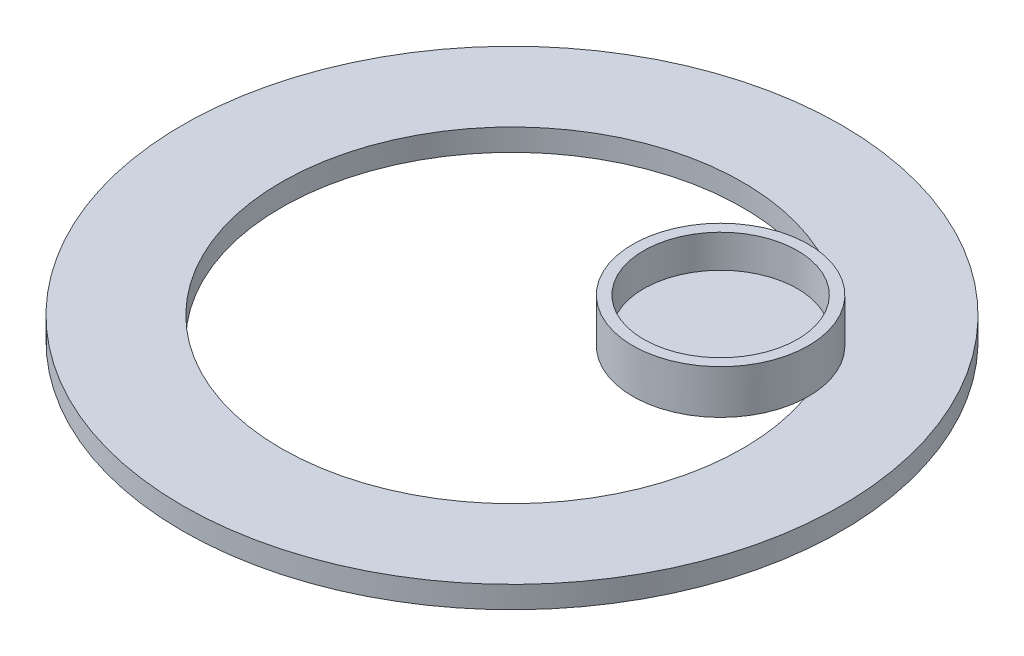
ISO-10303-21;
HEADER;
FILE_DESCRIPTION(('STEP AP214'),'2;1');
FILE_NAME('part.step','',(''),(''),'','','');
FILE_SCHEMA(('AUTOMOTIVE_DESIGN { 1 0 10303 214 1 1 1 1 }'));
ENDSEC;
DATA;
#1=APPLICATION_CONTEXT('core data for automotive mechanical design processes');
#2=APPLICATION_PROTOCOL_DEFINITION('international standard','automotive_design',2000,#1);
#3=PRODUCT_CONTEXT('',#1,'mechanical');
#4=PRODUCT('Part','Part','',(#3));
#5=PRODUCT_RELATED_PRODUCT_CATEGORY('part','',(#4));
#6=PRODUCT_DEFINITION_FORMATION('','',#4);
#7=PRODUCT_DEFINITION_CONTEXT('part definition',#1,'design');
#8=PRODUCT_DEFINITION('design','',#6,#7);
#9=PRODUCT_DEFINITION_SHAPE('','',#8);
#10=(LENGTH_UNIT() NAMED_UNIT(*) SI_UNIT(.MILLI.,.METRE.));
#11=(NAMED_UNIT(*) PLANE_ANGLE_UNIT() SI_UNIT($,.RADIAN.));
#12=(NAMED_UNIT(*) SI_UNIT($,.STERADIAN.) SOLID_ANGLE_UNIT());
#13=UNCERTAINTY_MEASURE_WITH_UNIT(LENGTH_MEASURE(1.E-05),#10,'distance_accuracy_value','');
#14=(GEOMETRIC_REPRESENTATION_CONTEXT(3) GLOBAL_UNCERTAINTY_ASSIGNED_CONTEXT((#13)) GLOBAL_UNIT_ASSIGNED_CONTEXT((#10,
#11,#12)) REPRESENTATION_CONTEXT('',''));
#15=CARTESIAN_POINT('',(0.,0.,0.));
#16=DIRECTION('',(0.,0.,1.));
#17=DIRECTION('',(1.,0.,0.));
#18=AXIS2_PLACEMENT_3D('',#15,#16,#17);
#19=CARTESIAN_POINT('',(0.,2.,0.));
#20=DIRECTION('',(0.,-1.,0.));
#21=DIRECTION('',(0.,0.,-1.));
#22=AXIS2_PLACEMENT_3D('',#19,#20,#21);
#23=CYLINDRICAL_SURFACE('',#22,30.);
#24=CARTESIAN_POINT('',(0.,2.,0.));
#25=DIRECTION('',(0.,1.,0.));
#26=DIRECTION('',(0.,0.,1.));
#27=AXIS2_PLACEMENT_3D('',#24,#25,#26);
#28=CIRCLE('',#27,30.);
#29=CARTESIAN_POINT('',(0.,2.,30.));
#30=VERTEX_POINT('',#29);
#31=EDGE_CURVE('E11',#30,#30,#28,.T.);
#32=ORIENTED_EDGE('',*,*,#31,.F.);
#33=EDGE_LOOP('',(#32));
#34=FACE_BOUND('',#33,.T.);
#35=CARTESIAN_POINT('',(0.,0.,0.));
#36=DIRECTION('',(0.,1.,0.));
#37=DIRECTION('',(0.,0.,1.));
#38=AXIS2_PLACEMENT_3D('',#35,#36,#37);
#39=CIRCLE('',#38,30.);
#40=CARTESIAN_POINT('',(0.,0.,30.));
#41=VERTEX_POINT('',#40);
#42=EDGE_CURVE('E35',#41,#41,#39,.T.);
#43=ORIENTED_EDGE('',*,*,#42,.T.);
#44=EDGE_LOOP('',(#43));
#45=FACE_BOUND('',#44,.T.);
#46=ADVANCED_FACE('F32',(#34,#45),#23,.T.);
#47=CARTESIAN_POINT('',(0.,2.,0.));
#48=DIRECTION('',(0.,1.,0.));
#49=DIRECTION('',(0.,0.,1.));
#50=AXIS2_PLACEMENT_3D('',#47,#48,#49);
#51=PLANE('',#50);
#52=CARTESIAN_POINT('',(11.8907306653898,2.,-7.09836702583289));
#53=DIRECTION('',(0.,1.,0.));
#54=DIRECTION('',(0.,0.,1.));
#55=AXIS2_PLACEMENT_3D('',#52,#53,#54);
#56=CIRCLE('',#55,8.);
#57=CARTESIAN_POINT('',(19.8834205316399,2.,-6.75644788050348));
#58=VERTEX_POINT('',#57);
#59=CARTESIAN_POINT('',(15.3824909572202,2.,-14.2961173732954));
#60=VERTEX_POINT('',#59);
#61=EDGE_CURVE('E45',#58,#60,#56,.T.);
#62=ORIENTED_EDGE('',*,*,#61,.F.);
#63=CARTESIAN_POINT('',(0.,2.,0.));
#64=DIRECTION('',(0.,1.,0.));
#65=DIRECTION('',(0.,0.,1.));
#66=AXIS2_PLACEMENT_3D('',#63,#64,#65);
#67=CIRCLE('',#66,21.);
#68=EDGE_CURVE('E52',#60,#58,#67,.T.);
#69=ORIENTED_EDGE('',*,*,#68,.F.);
#70=EDGE_LOOP('',(#62,#69));
#71=FACE_BOUND('',#70,.T.);
#72=ORIENTED_EDGE('',*,*,#31,.T.);
#73=EDGE_LOOP('',(#72));
#74=FACE_BOUND('',#73,.T.);
#75=ADVANCED_FACE('F58',(#71,#74),#51,.T.);
#76=CARTESIAN_POINT('',(0.,0.,0.));
#77=DIRECTION('',(0.,1.,0.));
#78=DIRECTION('',(0.,0.,1.));
#79=AXIS2_PLACEMENT_3D('',#76,#77,#78);
#80=PLANE('',#79);
#81=CARTESIAN_POINT('',(0.,0.,0.));
#82=DIRECTION('',(0.,1.,0.));
#83=DIRECTION('',(0.,0.,1.));
#84=AXIS2_PLACEMENT_3D('',#81,#82,#83);
#85=CIRCLE('',#84,21.);
#86=CARTESIAN_POINT('',(0.,0.,21.));
#87=VERTEX_POINT('',#86);
#88=EDGE_CURVE('E56',#87,#87,#85,.T.);
#89=ORIENTED_EDGE('',*,*,#88,.T.);
#90=EDGE_LOOP('',(#89));
#91=FACE_BOUND('',#90,.T.);
#92=ORIENTED_EDGE('',*,*,#42,.F.);
#93=EDGE_LOOP('',(#92));
#94=FACE_BOUND('',#93,.T.);
#95=ADVANCED_FACE('F78',(#91,#94),#80,.F.);
#96=CARTESIAN_POINT('',(0.,0.,0.));
#97=DIRECTION('',(0.,1.,0.));
#98=DIRECTION('',(0.,0.,1.));
#99=AXIS2_PLACEMENT_3D('',#96,#97,#98);
#100=CYLINDRICAL_SURFACE('',#99,21.);
#101=ORIENTED_EDGE('',*,*,#88,.F.);
#102=EDGE_LOOP('',(#101));
#103=FACE_BOUND('',#102,.T.);
#104=EDGE_CURVE('E50',#58,#60,#67,.T.);
#105=ORIENTED_EDGE('',*,*,#104,.T.);
#106=ORIENTED_EDGE('',*,*,#68,.T.);
#107=EDGE_LOOP('',(#105,#106));
#108=FACE_BOUND('',#107,.T.);
#109=ADVANCED_FACE('F51',(#103,#108),#100,.F.);
#110=CARTESIAN_POINT('',(11.8907306653898,6.,-7.09836702583289));
#111=DIRECTION('',(0.,-1.,0.));
#112=DIRECTION('',(0.,0.,-1.));
#113=AXIS2_PLACEMENT_3D('',#110,#111,#112);
#114=CYLINDRICAL_SURFACE('',#113,8.);
#115=CARTESIAN_POINT('',(11.8907306653898,6.,-7.09836702583289));
#116=DIRECTION('',(0.,1.,0.));
#117=DIRECTION('',(0.,0.,1.));
#118=AXIS2_PLACEMENT_3D('',#115,#116,#117);
#119=CIRCLE('',#118,8.);
#120=CARTESIAN_POINT('',(11.8907306653898,6.,0.901632974167116));
#121=VERTEX_POINT('',#120);
#122=EDGE_CURVE('E60',#121,#121,#119,.T.);
#123=ORIENTED_EDGE('',*,*,#122,.F.);
#124=EDGE_LOOP('',(#123));
#125=FACE_BOUND('',#124,.T.);
#126=ORIENTED_EDGE('',*,*,#61,.T.);
#127=EDGE_CURVE('E61',#60,#58,#56,.T.);
#128=ORIENTED_EDGE('',*,*,#127,.T.);
#129=EDGE_LOOP('',(#126,#128));
#130=FACE_BOUND('',#129,.T.);
#131=ADVANCED_FACE('F66',(#125,#130),#114,.T.);
#132=CARTESIAN_POINT('',(11.8907306653898,6.,-7.09836702583289));
#133=DIRECTION('',(0.,1.,0.));
#134=DIRECTION('',(0.,0.,1.));
#135=AXIS2_PLACEMENT_3D('',#132,#133,#134);
#136=PLANE('',#135);
#137=CARTESIAN_POINT('',(11.8907306653898,6.,-7.09836702583289));
#138=DIRECTION('',(0.,1.,0.));
#139=DIRECTION('',(0.,0.,1.));
#140=AXIS2_PLACEMENT_3D('',#137,#138,#139);
#141=CIRCLE('',#140,7.);
#142=CARTESIAN_POINT('',(11.8907306653898,6.,-0.0983670258328856));
#143=VERTEX_POINT('',#142);
#144=EDGE_CURVE('E157',#143,#143,#141,.T.);
#145=ORIENTED_EDGE('',*,*,#144,.F.);
#146=EDGE_LOOP('',(#145));
#147=FACE_BOUND('',#146,.T.);
#148=ORIENTED_EDGE('',*,*,#122,.T.);
#149=EDGE_LOOP('',(#148));
#150=FACE_BOUND('',#149,.T.);
#151=ADVANCED_FACE('F113',(#147,#150),#136,.T.);
#152=CARTESIAN_POINT('',(11.8907306653898,2.,-7.09836702583289));
#153=DIRECTION('',(0.,1.,0.));
#154=DIRECTION('',(0.,0.,1.));
#155=AXIS2_PLACEMENT_3D('',#152,#153,#154);
#156=PLANE('',#155);
#157=ORIENTED_EDGE('',*,*,#104,.F.);
#158=ORIENTED_EDGE('',*,*,#127,.F.);
#159=EDGE_LOOP('',(#157,#158));
#160=FACE_BOUND('',#159,.T.);
#161=ADVANCED_FACE('F62',(#160),#156,.F.);
#162=CARTESIAN_POINT('',(11.8907306653898,3.,-7.09836702583289));
#163=DIRECTION('',(0.,1.,0.));
#164=DIRECTION('',(0.,0.,1.));
#165=AXIS2_PLACEMENT_3D('',#162,#163,#164);
#166=CYLINDRICAL_SURFACE('',#165,7.);
#167=CARTESIAN_POINT('',(11.8907306653898,3.,-7.09836702583289));
#168=DIRECTION('',(0.,1.,0.));
#169=DIRECTION('',(0.,0.,1.));
#170=AXIS2_PLACEMENT_3D('',#167,#168,#169);
#171=CIRCLE('',#170,7.);
#172=CARTESIAN_POINT('',(11.8907306653898,3.,-0.0983670258328856));
#173=VERTEX_POINT('',#172);
#174=EDGE_CURVE('E64',#173,#173,#171,.T.);
#175=ORIENTED_EDGE('',*,*,#174,.F.);
#176=EDGE_LOOP('',(#175));
#177=FACE_BOUND('',#176,.T.);
#178=ORIENTED_EDGE('',*,*,#144,.T.);
#179=EDGE_LOOP('',(#178));
#180=FACE_BOUND('',#179,.T.);
#181=ADVANCED_FACE('F125',(#177,#180),#166,.F.);
#182=CARTESIAN_POINT('',(11.8907306653898,3.,-7.09836702583289));
#183=DIRECTION('',(0.,1.,0.));
#184=DIRECTION('',(0.,0.,1.));
#185=AXIS2_PLACEMENT_3D('',#182,#183,#184);
#186=PLANE('',#185);
#187=ORIENTED_EDGE('',*,*,#174,.T.);
#188=EDGE_LOOP('',(#187));
#189=FACE_BOUND('',#188,.T.);
#190=ADVANCED_FACE('F141',(#189),#186,.T.);
#191=CLOSED_SHELL('',(#46,#75,#95,#109,#131,#151,#161,#181,#190));
#192=MANIFOLD_SOLID_BREP('B2',#191);
#193=ADVANCED_BREP_SHAPE_REPRESENTATION('',(#18,#192),#14);
#194=SHAPE_DEFINITION_REPRESENTATION(#9,#193);
ENDSEC;
END-ISO-10303-21;
